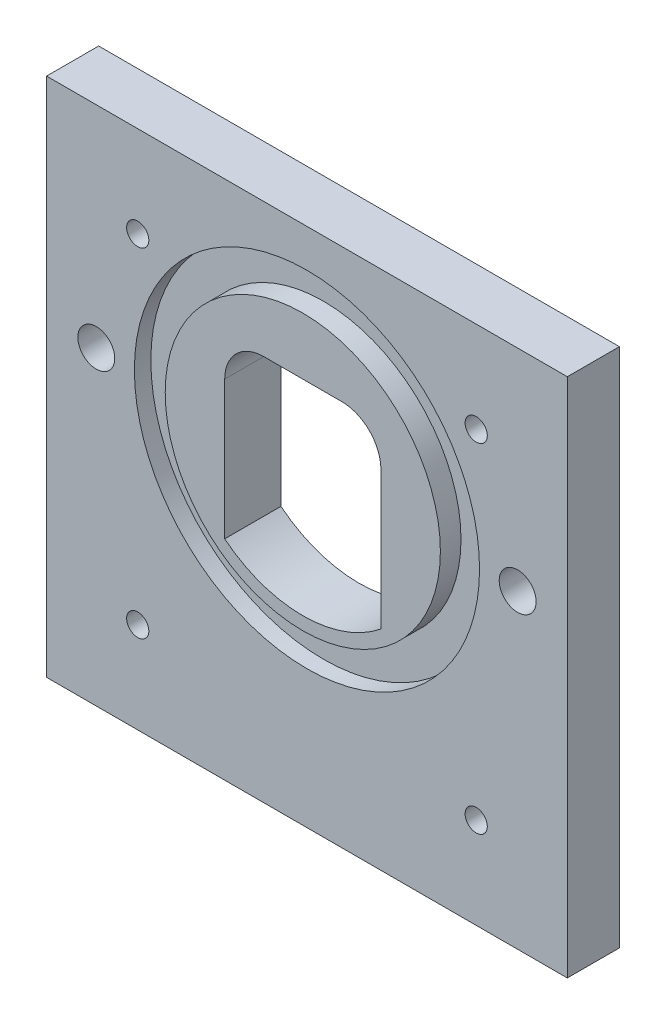
ISO-10303-21;
HEADER;
FILE_DESCRIPTION(('STEP AP214'),'2;1');
FILE_NAME('part.step','',(''),(''),'','','');
FILE_SCHEMA(('AUTOMOTIVE_DESIGN { 1 0 10303 214 1 1 1 1 }'));
ENDSEC;
DATA;
#1=APPLICATION_CONTEXT('core data for automotive mechanical design processes');
#2=APPLICATION_PROTOCOL_DEFINITION('international standard','automotive_design',2000,#1);
#3=PRODUCT_CONTEXT('',#1,'mechanical');
#4=PRODUCT('Part','Part','',(#3));
#5=PRODUCT_RELATED_PRODUCT_CATEGORY('part','',(#4));
#6=PRODUCT_DEFINITION_FORMATION('','',#4);
#7=PRODUCT_DEFINITION_CONTEXT('part definition',#1,'design');
#8=PRODUCT_DEFINITION('design','',#6,#7);
#9=PRODUCT_DEFINITION_SHAPE('','',#8);
#10=(LENGTH_UNIT() NAMED_UNIT(*) SI_UNIT(.MILLI.,.METRE.));
#11=(NAMED_UNIT(*) PLANE_ANGLE_UNIT() SI_UNIT($,.RADIAN.));
#12=(NAMED_UNIT(*) SI_UNIT($,.STERADIAN.) SOLID_ANGLE_UNIT());
#13=UNCERTAINTY_MEASURE_WITH_UNIT(LENGTH_MEASURE(1.E-05),#10,'distance_accuracy_value','');
#14=(GEOMETRIC_REPRESENTATION_CONTEXT(3) GLOBAL_UNCERTAINTY_ASSIGNED_CONTEXT((#13)) GLOBAL_UNIT_ASSIGNED_CONTEXT((#10,
#11,#12)) REPRESENTATION_CONTEXT('',''));
#15=CARTESIAN_POINT('',(0.,0.,0.));
#16=DIRECTION('',(0.,0.,1.));
#17=DIRECTION('',(1.,0.,0.));
#18=AXIS2_PLACEMENT_3D('',#15,#16,#17);
#19=CARTESIAN_POINT('',(31.75,-31.75,6.35));
#20=DIRECTION('',(-1.,0.,0.));
#21=DIRECTION('',(0.,0.,1.));
#22=AXIS2_PLACEMENT_3D('',#19,#20,#21);
#23=PLANE('',#22);
#24=DIRECTION('',(0.,1.,0.));
#25=VECTOR('',#24,1.);
#26=CARTESIAN_POINT('',(31.75,-31.75,0.));
#27=LINE('',#26,#25);
#28=CARTESIAN_POINT('',(31.75,-31.75,0.));
#29=VERTEX_POINT('',#28);
#30=CARTESIAN_POINT('',(31.75,31.75,0.));
#31=VERTEX_POINT('',#30);
#32=EDGE_CURVE('E211',#29,#31,#27,.T.);
#33=ORIENTED_EDGE('',*,*,#32,.T.);
#34=DIRECTION('',(0.,0.,-1.));
#35=VECTOR('',#34,1.);
#36=CARTESIAN_POINT('',(31.75,31.75,6.35));
#37=LINE('',#36,#35);
#38=CARTESIAN_POINT('',(31.75,31.75,6.35));
#39=VERTEX_POINT('',#38);
#40=EDGE_CURVE('E11',#39,#31,#37,.T.);
#41=ORIENTED_EDGE('',*,*,#40,.F.);
#42=DIRECTION('',(0.,1.,0.));
#43=VECTOR('',#42,1.);
#44=CARTESIAN_POINT('',(31.75,-31.75,6.35));
#45=LINE('',#44,#43);
#46=CARTESIAN_POINT('',(31.75,-31.75,6.35));
#47=VERTEX_POINT('',#46);
#48=EDGE_CURVE('E212',#47,#39,#45,.T.);
#49=ORIENTED_EDGE('',*,*,#48,.F.);
#50=DIRECTION('',(0.,0.,-1.));
#51=VECTOR('',#50,1.);
#52=CARTESIAN_POINT('',(31.75,-31.75,6.35));
#53=LINE('',#52,#51);
#54=EDGE_CURVE('E222',#47,#29,#53,.T.);
#55=ORIENTED_EDGE('',*,*,#54,.T.);
#56=EDGE_LOOP('',(#33,#41,#49,#55));
#57=FACE_BOUND('',#56,.T.);
#58=ADVANCED_FACE('F32',(#57),#23,.F.);
#59=CARTESIAN_POINT('',(-31.75,31.75,6.35));
#60=DIRECTION('',(0.,-1.,0.));
#61=DIRECTION('',(0.,0.,-1.));
#62=AXIS2_PLACEMENT_3D('',#59,#60,#61);
#63=PLANE('',#62);
#64=DIRECTION('',(-1.,0.,0.));
#65=VECTOR('',#64,1.);
#66=CARTESIAN_POINT('',(-31.75,31.75,0.));
#67=LINE('',#66,#65);
#68=CARTESIAN_POINT('',(-31.75,31.75,0.));
#69=VERTEX_POINT('',#68);
#70=EDGE_CURVE('E225',#31,#69,#67,.T.);
#71=ORIENTED_EDGE('',*,*,#70,.T.);
#72=DIRECTION('',(0.,0.,-1.));
#73=VECTOR('',#72,1.);
#74=CARTESIAN_POINT('',(-31.75,31.75,6.35));
#75=LINE('',#74,#73);
#76=CARTESIAN_POINT('',(-31.75,31.75,6.35));
#77=VERTEX_POINT('',#76);
#78=EDGE_CURVE('E40',#77,#69,#75,.T.);
#79=ORIENTED_EDGE('',*,*,#78,.F.);
#80=DIRECTION('',(-1.,0.,0.));
#81=VECTOR('',#80,1.);
#82=CARTESIAN_POINT('',(-31.75,31.75,6.35));
#83=LINE('',#82,#81);
#84=EDGE_CURVE('E215',#39,#77,#83,.T.);
#85=ORIENTED_EDGE('',*,*,#84,.F.);
#86=ORIENTED_EDGE('',*,*,#40,.T.);
#87=EDGE_LOOP('',(#71,#79,#85,#86));
#88=FACE_BOUND('',#87,.T.);
#89=ADVANCED_FACE('F257',(#88),#63,.F.);
#90=CARTESIAN_POINT('',(-31.75,-31.75,6.35));
#91=DIRECTION('',(1.,0.,0.));
#92=DIRECTION('',(0.,0.,-1.));
#93=AXIS2_PLACEMENT_3D('',#90,#91,#92);
#94=PLANE('',#93);
#95=DIRECTION('',(0.,-1.,0.));
#96=VECTOR('',#95,1.);
#97=CARTESIAN_POINT('',(-31.75,-31.75,0.));
#98=LINE('',#97,#96);
#99=CARTESIAN_POINT('',(-31.75,-31.75,0.));
#100=VERTEX_POINT('',#99);
#101=EDGE_CURVE('E227',#69,#100,#98,.T.);
#102=ORIENTED_EDGE('',*,*,#101,.T.);
#103=DIRECTION('',(0.,0.,-1.));
#104=VECTOR('',#103,1.);
#105=CARTESIAN_POINT('',(-31.75,-31.75,6.35));
#106=LINE('',#105,#104);
#107=CARTESIAN_POINT('',(-31.75,-31.75,6.35));
#108=VERTEX_POINT('',#107);
#109=EDGE_CURVE('E232',#108,#100,#106,.T.);
#110=ORIENTED_EDGE('',*,*,#109,.F.);
#111=DIRECTION('',(0.,-1.,0.));
#112=VECTOR('',#111,1.);
#113=CARTESIAN_POINT('',(-31.75,-31.75,6.35));
#114=LINE('',#113,#112);
#115=EDGE_CURVE('E218',#77,#108,#114,.T.);
#116=ORIENTED_EDGE('',*,*,#115,.F.);
#117=ORIENTED_EDGE('',*,*,#78,.T.);
#118=EDGE_LOOP('',(#102,#110,#116,#117));
#119=FACE_BOUND('',#118,.T.);
#120=ADVANCED_FACE('F262',(#119),#94,.F.);
#121=CARTESIAN_POINT('',(-31.75,-31.75,6.35));
#122=DIRECTION('',(0.,1.,0.));
#123=DIRECTION('',(0.,0.,1.));
#124=AXIS2_PLACEMENT_3D('',#121,#122,#123);
#125=PLANE('',#124);
#126=DIRECTION('',(1.,0.,0.));
#127=VECTOR('',#126,1.);
#128=CARTESIAN_POINT('',(-31.75,-31.75,0.));
#129=LINE('',#128,#127);
#130=EDGE_CURVE('E216',#100,#29,#129,.T.);
#131=ORIENTED_EDGE('',*,*,#130,.T.);
#132=ORIENTED_EDGE('',*,*,#54,.F.);
#133=DIRECTION('',(1.,0.,0.));
#134=VECTOR('',#133,1.);
#135=CARTESIAN_POINT('',(-31.75,-31.75,6.35));
#136=LINE('',#135,#134);
#137=EDGE_CURVE('E220',#108,#47,#136,.T.);
#138=ORIENTED_EDGE('',*,*,#137,.F.);
#139=ORIENTED_EDGE('',*,*,#109,.T.);
#140=EDGE_LOOP('',(#131,#132,#138,#139));
#141=FACE_BOUND('',#140,.T.);
#142=ADVANCED_FACE('F278',(#141),#125,.F.);
#143=CARTESIAN_POINT('',(31.75,31.75,6.35));
#144=DIRECTION('',(0.,0.,-1.));
#145=DIRECTION('',(-1.,0.,0.));
#146=AXIS2_PLACEMENT_3D('',#143,#144,#145);
#147=PLANE('',#146);
#148=CARTESIAN_POINT('',(25.6911768305445,6.07686515337297,6.35));
#149=DIRECTION('',(0.,0.,-1.));
#150=DIRECTION('',(-1.,0.,0.));
#151=AXIS2_PLACEMENT_3D('',#148,#149,#150);
#152=CIRCLE('',#151,2.25);
#153=CARTESIAN_POINT('',(23.4411768305445,6.07686515337297,6.35));
#154=VERTEX_POINT('',#153);
#155=EDGE_CURVE('E35',#154,#154,#152,.T.);
#156=ORIENTED_EDGE('',*,*,#155,.T.);
#157=EDGE_LOOP('',(#156));
#158=FACE_BOUND('',#157,.T.);
#159=CARTESIAN_POINT('',(-25.6911768305436,6.07686515337297,6.35));
#160=DIRECTION('',(0.,0.,-1.));
#161=DIRECTION('',(-1.,0.,0.));
#162=AXIS2_PLACEMENT_3D('',#159,#160,#161);
#163=CIRCLE('',#162,2.25);
#164=CARTESIAN_POINT('',(-27.9411768305436,6.07686515337297,6.35));
#165=VERTEX_POINT('',#164);
#166=EDGE_CURVE('E174',#165,#165,#163,.T.);
#167=ORIENTED_EDGE('',*,*,#166,.T.);
#168=EDGE_LOOP('',(#167));
#169=FACE_BOUND('',#168,.T.);
#170=CARTESIAN_POINT('',(1.67183974997265E-13,6.07686515337297,6.35));
#171=DIRECTION('',(0.,0.,1.));
#172=DIRECTION('',(1.,0.,0.));
#173=AXIS2_PLACEMENT_3D('',#170,#171,#172);
#174=CIRCLE('',#173,21.0439);
#175=CARTESIAN_POINT('',(21.0439000000002,6.07686515337297,6.35));
#176=VERTEX_POINT('',#175);
#177=EDGE_CURVE('E181',#176,#176,#174,.T.);
#178=ORIENTED_EDGE('',*,*,#177,.F.);
#179=EDGE_LOOP('',(#178));
#180=FACE_BOUND('',#179,.T.);
#181=CARTESIAN_POINT('',(-20.6375,-20.6375,6.35));
#182=DIRECTION('',(0.,0.,-1.));
#183=DIRECTION('',(-1.,0.,0.));
#184=AXIS2_PLACEMENT_3D('',#181,#182,#183);
#185=CIRCLE('',#184,1.35255);
#186=CARTESIAN_POINT('',(-21.99005,-20.6375,6.35));
#187=VERTEX_POINT('',#186);
#188=EDGE_CURVE('E190',#187,#187,#185,.T.);
#189=ORIENTED_EDGE('',*,*,#188,.T.);
#190=EDGE_LOOP('',(#189));
#191=FACE_BOUND('',#190,.T.);
#192=CARTESIAN_POINT('',(20.6375,-20.6375,6.35));
#193=DIRECTION('',(0.,0.,-1.));
#194=DIRECTION('',(-1.,0.,0.));
#195=AXIS2_PLACEMENT_3D('',#192,#193,#194);
#196=CIRCLE('',#195,1.35255);
#197=CARTESIAN_POINT('',(19.28495,-20.6375,6.35));
#198=VERTEX_POINT('',#197);
#199=EDGE_CURVE('E196',#198,#198,#196,.T.);
#200=ORIENTED_EDGE('',*,*,#199,.T.);
#201=EDGE_LOOP('',(#200));
#202=FACE_BOUND('',#201,.T.);
#203=CARTESIAN_POINT('',(20.6375,20.6375,6.35));
#204=DIRECTION('',(0.,0.,-1.));
#205=DIRECTION('',(-1.,0.,0.));
#206=AXIS2_PLACEMENT_3D('',#203,#204,#205);
#207=CIRCLE('',#206,1.35255);
#208=CARTESIAN_POINT('',(19.28495,20.6375,6.35));
#209=VERTEX_POINT('',#208);
#210=EDGE_CURVE('E202',#209,#209,#207,.T.);
#211=ORIENTED_EDGE('',*,*,#210,.T.);
#212=EDGE_LOOP('',(#211));
#213=FACE_BOUND('',#212,.T.);
#214=CARTESIAN_POINT('',(-20.6375,20.6375,6.35));
#215=DIRECTION('',(0.,0.,-1.));
#216=DIRECTION('',(-1.,0.,0.));
#217=AXIS2_PLACEMENT_3D('',#214,#215,#216);
#218=CIRCLE('',#217,1.35255);
#219=CARTESIAN_POINT('',(-21.99005,20.6375,6.35));
#220=VERTEX_POINT('',#219);
#221=EDGE_CURVE('E208',#220,#220,#218,.T.);
#222=ORIENTED_EDGE('',*,*,#221,.T.);
#223=EDGE_LOOP('',(#222));
#224=FACE_BOUND('',#223,.T.);
#225=ORIENTED_EDGE('',*,*,#48,.T.);
#226=ORIENTED_EDGE('',*,*,#84,.T.);
#227=ORIENTED_EDGE('',*,*,#115,.T.);
#228=ORIENTED_EDGE('',*,*,#137,.T.);
#229=EDGE_LOOP('',(#225,#226,#227,#228));
#230=FACE_BOUND('',#229,.T.);
#231=ADVANCED_FACE('F239',(#158,#169,#180,#191,#202,#213,#224,#230),#147,.F.);
#232=CARTESIAN_POINT('',(31.75,31.75,0.));
#233=DIRECTION('',(0.,0.,-1.));
#234=DIRECTION('',(-1.,0.,0.));
#235=AXIS2_PLACEMENT_3D('',#232,#233,#234);
#236=PLANE('',#235);
#237=CARTESIAN_POINT('',(-4.7625,11.1125,0.));
#238=DIRECTION('',(0.,0.,-1.));
#239=DIRECTION('',(-1.,0.,0.));
#240=AXIS2_PLACEMENT_3D('',#237,#238,#239);
#241=CIRCLE('',#240,4.7625);
#242=CARTESIAN_POINT('',(-9.525,11.1125,0.));
#243=VERTEX_POINT('',#242);
#244=CARTESIAN_POINT('',(-4.7625,15.875,0.));
#245=VERTEX_POINT('',#244);
#246=EDGE_CURVE('E48',#243,#245,#241,.T.);
#247=ORIENTED_EDGE('',*,*,#246,.F.);
#248=DIRECTION('',(0.,1.,0.));
#249=VECTOR('',#248,1.);
#250=CARTESIAN_POINT('',(-9.525,11.1125,0.));
#251=LINE('',#250,#249);
#252=CARTESIAN_POINT('',(-9.525,-5.75471004353972,0.));
#253=VERTEX_POINT('',#252);
#254=EDGE_CURVE('E129',#253,#243,#251,.T.);
#255=ORIENTED_EDGE('',*,*,#254,.F.);
#256=CARTESIAN_POINT('',(0.,6.07686515337317,0.));
#257=DIRECTION('',(0.,0.,-1.));
#258=DIRECTION('',(-1.,0.,0.));
#259=AXIS2_PLACEMENT_3D('',#256,#257,#258);
#260=CIRCLE('',#259,15.1892000000067);
#261=CARTESIAN_POINT('',(9.525,-5.75471004353972,0.));
#262=VERTEX_POINT('',#261);
#263=EDGE_CURVE('E132',#262,#253,#260,.T.);
#264=ORIENTED_EDGE('',*,*,#263,.F.);
#265=DIRECTION('',(0.,-1.,0.));
#266=VECTOR('',#265,1.);
#267=CARTESIAN_POINT('',(9.525,11.1125,0.));
#268=LINE('',#267,#266);
#269=CARTESIAN_POINT('',(9.525,11.1125,0.));
#270=VERTEX_POINT('',#269);
#271=EDGE_CURVE('E148',#270,#262,#268,.T.);
#272=ORIENTED_EDGE('',*,*,#271,.F.);
#273=CARTESIAN_POINT('',(4.7625,11.1125,0.));
#274=DIRECTION('',(0.,0.,-1.));
#275=DIRECTION('',(1.,0.,0.));
#276=AXIS2_PLACEMENT_3D('',#273,#274,#275);
#277=CIRCLE('',#276,4.7625);
#278=CARTESIAN_POINT('',(4.7625,15.875,0.));
#279=VERTEX_POINT('',#278);
#280=EDGE_CURVE('E145',#279,#270,#277,.T.);
#281=ORIENTED_EDGE('',*,*,#280,.F.);
#282=DIRECTION('',(1.,0.,0.));
#283=VECTOR('',#282,1.);
#284=CARTESIAN_POINT('',(-4.7625,15.875,0.));
#285=LINE('',#284,#283);
#286=EDGE_CURVE('E143',#245,#279,#285,.T.);
#287=ORIENTED_EDGE('',*,*,#286,.F.);
#288=EDGE_LOOP('',(#247,#255,#264,#272,#281,#287));
#289=FACE_BOUND('',#288,.T.);
#290=CARTESIAN_POINT('',(25.6911768305445,6.07686515337297,0.));
#291=DIRECTION('',(0.,0.,-1.));
#292=DIRECTION('',(-1.,0.,0.));
#293=AXIS2_PLACEMENT_3D('',#290,#291,#292);
#294=CIRCLE('',#293,4.7);
#295=CARTESIAN_POINT('',(20.9911768305445,6.07686515337297,0.));
#296=VERTEX_POINT('',#295);
#297=EDGE_CURVE('E155',#296,#296,#294,.T.);
#298=ORIENTED_EDGE('',*,*,#297,.F.);
#299=EDGE_LOOP('',(#298));
#300=FACE_BOUND('',#299,.T.);
#301=CARTESIAN_POINT('',(-25.6911768305436,6.07686515337297,0.));
#302=DIRECTION('',(0.,0.,-1.));
#303=DIRECTION('',(-1.,0.,0.));
#304=AXIS2_PLACEMENT_3D('',#301,#302,#303);
#305=CIRCLE('',#304,4.7);
#306=CARTESIAN_POINT('',(-30.3911768305436,6.07686515337297,0.));
#307=VERTEX_POINT('',#306);
#308=EDGE_CURVE('E168',#307,#307,#305,.T.);
#309=ORIENTED_EDGE('',*,*,#308,.F.);
#310=EDGE_LOOP('',(#309));
#311=FACE_BOUND('',#310,.T.);
#312=CARTESIAN_POINT('',(-20.6375,-20.6375,0.));
#313=DIRECTION('',(0.,0.,-1.));
#314=DIRECTION('',(-1.,0.,0.));
#315=AXIS2_PLACEMENT_3D('',#312,#313,#314);
#316=CIRCLE('',#315,1.35254999999999);
#317=CARTESIAN_POINT('',(-21.99005,-20.6375,0.));
#318=VERTEX_POINT('',#317);
#319=EDGE_CURVE('E185',#318,#318,#316,.T.);
#320=ORIENTED_EDGE('',*,*,#319,.F.);
#321=EDGE_LOOP('',(#320));
#322=FACE_BOUND('',#321,.T.);
#323=CARTESIAN_POINT('',(20.6375,-20.6375,0.));
#324=DIRECTION('',(0.,0.,-1.));
#325=DIRECTION('',(-1.,0.,0.));
#326=AXIS2_PLACEMENT_3D('',#323,#324,#325);
#327=CIRCLE('',#326,1.35254999999999);
#328=CARTESIAN_POINT('',(19.28495,-20.6375,0.));
#329=VERTEX_POINT('',#328);
#330=EDGE_CURVE('E193',#329,#329,#327,.T.);
#331=ORIENTED_EDGE('',*,*,#330,.F.);
#332=EDGE_LOOP('',(#331));
#333=FACE_BOUND('',#332,.T.);
#334=CARTESIAN_POINT('',(20.6375,20.6375,0.));
#335=DIRECTION('',(0.,0.,-1.));
#336=DIRECTION('',(-1.,0.,0.));
#337=AXIS2_PLACEMENT_3D('',#334,#335,#336);
#338=CIRCLE('',#337,1.35254999999999);
#339=CARTESIAN_POINT('',(19.28495,20.6375,0.));
#340=VERTEX_POINT('',#339);
#341=EDGE_CURVE('E199',#340,#340,#338,.T.);
#342=ORIENTED_EDGE('',*,*,#341,.F.);
#343=EDGE_LOOP('',(#342));
#344=FACE_BOUND('',#343,.T.);
#345=CARTESIAN_POINT('',(-20.6375,20.6375,0.));
#346=DIRECTION('',(0.,0.,-1.));
#347=DIRECTION('',(-1.,0.,0.));
#348=AXIS2_PLACEMENT_3D('',#345,#346,#347);
#349=CIRCLE('',#348,1.35254999999999);
#350=CARTESIAN_POINT('',(-21.99005,20.6375,0.));
#351=VERTEX_POINT('',#350);
#352=EDGE_CURVE('E205',#351,#351,#349,.T.);
#353=ORIENTED_EDGE('',*,*,#352,.F.);
#354=EDGE_LOOP('',(#353));
#355=FACE_BOUND('',#354,.T.);
#356=ORIENTED_EDGE('',*,*,#32,.F.);
#357=ORIENTED_EDGE('',*,*,#130,.F.);
#358=ORIENTED_EDGE('',*,*,#101,.F.);
#359=ORIENTED_EDGE('',*,*,#70,.F.);
#360=EDGE_LOOP('',(#356,#357,#358,#359));
#361=FACE_BOUND('',#360,.T.);
#362=ADVANCED_FACE('F270',(#289,#300,#311,#322,#333,#344,#355,#361),#236,.T.);
#363=CARTESIAN_POINT('',(-20.6375,20.6375,0.));
#364=DIRECTION('',(0.,0.,-1.));
#365=DIRECTION('',(-1.,0.,0.));
#366=AXIS2_PLACEMENT_3D('',#363,#364,#365);
#367=CYLINDRICAL_SURFACE('',#366,1.35254999999999);
#368=ORIENTED_EDGE('',*,*,#221,.F.);
#369=EDGE_LOOP('',(#368));
#370=FACE_BOUND('',#369,.T.);
#371=ORIENTED_EDGE('',*,*,#352,.T.);
#372=EDGE_LOOP('',(#371));
#373=FACE_BOUND('',#372,.T.);
#374=ADVANCED_FACE('F289',(#370,#373),#367,.F.);
#375=CARTESIAN_POINT('',(20.6375,20.6375,0.));
#376=DIRECTION('',(0.,0.,-1.));
#377=DIRECTION('',(-1.,0.,0.));
#378=AXIS2_PLACEMENT_3D('',#375,#376,#377);
#379=CYLINDRICAL_SURFACE('',#378,1.35254999999999);
#380=ORIENTED_EDGE('',*,*,#210,.F.);
#381=EDGE_LOOP('',(#380));
#382=FACE_BOUND('',#381,.T.);
#383=ORIENTED_EDGE('',*,*,#341,.T.);
#384=EDGE_LOOP('',(#383));
#385=FACE_BOUND('',#384,.T.);
#386=ADVANCED_FACE('F296',(#382,#385),#379,.F.);
#387=CARTESIAN_POINT('',(20.6375,-20.6375,0.));
#388=DIRECTION('',(0.,0.,-1.));
#389=DIRECTION('',(-1.,0.,0.));
#390=AXIS2_PLACEMENT_3D('',#387,#388,#389);
#391=CYLINDRICAL_SURFACE('',#390,1.35254999999999);
#392=ORIENTED_EDGE('',*,*,#199,.F.);
#393=EDGE_LOOP('',(#392));
#394=FACE_BOUND('',#393,.T.);
#395=ORIENTED_EDGE('',*,*,#330,.T.);
#396=EDGE_LOOP('',(#395));
#397=FACE_BOUND('',#396,.T.);
#398=ADVANCED_FACE('F300',(#394,#397),#391,.F.);
#399=CARTESIAN_POINT('',(-20.6375,-20.6375,0.));
#400=DIRECTION('',(0.,0.,-1.));
#401=DIRECTION('',(-1.,0.,0.));
#402=AXIS2_PLACEMENT_3D('',#399,#400,#401);
#403=CYLINDRICAL_SURFACE('',#402,1.35254999999999);
#404=ORIENTED_EDGE('',*,*,#188,.F.);
#405=EDGE_LOOP('',(#404));
#406=FACE_BOUND('',#405,.T.);
#407=ORIENTED_EDGE('',*,*,#319,.T.);
#408=EDGE_LOOP('',(#407));
#409=FACE_BOUND('',#408,.T.);
#410=ADVANCED_FACE('F304',(#406,#409),#403,.F.);
#411=CARTESIAN_POINT('',(1.67183974997265E-13,6.07686515337297,4.3434));
#412=DIRECTION('',(0.,0.,1.));
#413=DIRECTION('',(1.,0.,0.));
#414=AXIS2_PLACEMENT_3D('',#411,#412,#413);
#415=CYLINDRICAL_SURFACE('',#414,21.0439);
#416=CARTESIAN_POINT('',(1.67183974997265E-13,6.07686515337297,4.3434));
#417=DIRECTION('',(0.,0.,1.));
#418=DIRECTION('',(1.,0.,0.));
#419=AXIS2_PLACEMENT_3D('',#416,#417,#418);
#420=CIRCLE('',#419,21.0439);
#421=CARTESIAN_POINT('',(21.0439000000002,6.07686515337297,4.3434));
#422=VERTEX_POINT('',#421);
#423=EDGE_CURVE('E182',#422,#422,#420,.T.);
#424=ORIENTED_EDGE('',*,*,#423,.F.);
#425=EDGE_LOOP('',(#424));
#426=FACE_BOUND('',#425,.T.);
#427=ORIENTED_EDGE('',*,*,#177,.T.);
#428=EDGE_LOOP('',(#427));
#429=FACE_BOUND('',#428,.T.);
#430=ADVANCED_FACE('F308',(#426,#429),#415,.F.);
#431=CARTESIAN_POINT('',(1.67183974997265E-13,6.07686515337297,4.3434));
#432=DIRECTION('',(0.,0.,1.));
#433=DIRECTION('',(1.,0.,0.));
#434=AXIS2_PLACEMENT_3D('',#431,#432,#433);
#435=PLANE('',#434);
#436=CARTESIAN_POINT('',(1.67183974997265E-13,6.07686515337297,4.3434));
#437=DIRECTION('',(0.,0.,1.));
#438=DIRECTION('',(1.,0.,0.));
#439=AXIS2_PLACEMENT_3D('',#436,#437,#438);
#440=CIRCLE('',#439,16.7767);
#441=CARTESIAN_POINT('',(16.7767000000002,6.07686515337297,4.3434));
#442=VERTEX_POINT('',#441);
#443=EDGE_CURVE('E178',#442,#442,#440,.T.);
#444=ORIENTED_EDGE('',*,*,#443,.F.);
#445=EDGE_LOOP('',(#444));
#446=FACE_BOUND('',#445,.T.);
#447=ORIENTED_EDGE('',*,*,#423,.T.);
#448=EDGE_LOOP('',(#447));
#449=FACE_BOUND('',#448,.T.);
#450=ADVANCED_FACE('F312',(#446,#449),#435,.T.);
#451=CARTESIAN_POINT('',(1.67183974997265E-13,6.07686515337297,4.3434));
#452=DIRECTION('',(0.,0.,1.));
#453=DIRECTION('',(1.,0.,0.));
#454=AXIS2_PLACEMENT_3D('',#451,#452,#453);
#455=CYLINDRICAL_SURFACE('',#454,16.7767);
#456=ORIENTED_EDGE('',*,*,#443,.T.);
#457=EDGE_LOOP('',(#456));
#458=FACE_BOUND('',#457,.T.);
#459=CARTESIAN_POINT('',(1.67183974997265E-13,6.07686515337297,6.858));
#460=DIRECTION('',(0.,0.,1.));
#461=DIRECTION('',(1.,0.,0.));
#462=AXIS2_PLACEMENT_3D('',#459,#460,#461);
#463=CIRCLE('',#462,16.7767000000067);
#464=CARTESIAN_POINT('',(16.7767000000068,6.07686515337297,6.858));
#465=VERTEX_POINT('',#464);
#466=EDGE_CURVE('E175',#465,#465,#463,.T.);
#467=ORIENTED_EDGE('',*,*,#466,.F.);
#468=EDGE_LOOP('',(#467));
#469=FACE_BOUND('',#468,.T.);
#470=ADVANCED_FACE('F254',(#458,#469),#455,.T.);
#471=CARTESIAN_POINT('',(1.67183974997265E-13,6.07686515337297,6.858));
#472=DIRECTION('',(0.,0.,1.));
#473=DIRECTION('',(1.,0.,0.));
#474=AXIS2_PLACEMENT_3D('',#471,#472,#473);
#475=PLANE('',#474);
#476=CARTESIAN_POINT('',(-4.7625,11.1125,6.858));
#477=DIRECTION('',(0.,0.,-1.));
#478=DIRECTION('',(-1.,0.,0.));
#479=AXIS2_PLACEMENT_3D('',#476,#477,#478);
#480=CIRCLE('',#479,4.7625);
#481=CARTESIAN_POINT('',(-9.525,11.1125,6.858));
#482=VERTEX_POINT('',#481);
#483=CARTESIAN_POINT('',(-4.7625,15.875,6.858));
#484=VERTEX_POINT('',#483);
#485=EDGE_CURVE('E112',#482,#484,#480,.T.);
#486=ORIENTED_EDGE('',*,*,#485,.T.);
#487=DIRECTION('',(1.,0.,0.));
#488=VECTOR('',#487,1.);
#489=CARTESIAN_POINT('',(-4.7625,15.875,6.858));
#490=LINE('',#489,#488);
#491=CARTESIAN_POINT('',(4.7625,15.875,6.858));
#492=VERTEX_POINT('',#491);
#493=EDGE_CURVE('E121',#484,#492,#490,.T.);
#494=ORIENTED_EDGE('',*,*,#493,.T.);
#495=CARTESIAN_POINT('',(4.7625,11.1125,6.858));
#496=DIRECTION('',(0.,0.,-1.));
#497=DIRECTION('',(1.,0.,0.));
#498=AXIS2_PLACEMENT_3D('',#495,#496,#497);
#499=CIRCLE('',#498,4.7625);
#500=CARTESIAN_POINT('',(9.525,11.1125,6.858));
#501=VERTEX_POINT('',#500);
#502=EDGE_CURVE('E56',#492,#501,#499,.T.);
#503=ORIENTED_EDGE('',*,*,#502,.T.);
#504=DIRECTION('',(0.,-1.,0.));
#505=VECTOR('',#504,1.);
#506=CARTESIAN_POINT('',(9.525,11.1125,6.858));
#507=LINE('',#506,#505);
#508=CARTESIAN_POINT('',(9.525,-5.75471004353972,6.858));
#509=VERTEX_POINT('',#508);
#510=EDGE_CURVE('E136',#501,#509,#507,.T.);
#511=ORIENTED_EDGE('',*,*,#510,.T.);
#512=CARTESIAN_POINT('',(0.,6.07686515337317,6.858));
#513=DIRECTION('',(0.,0.,-1.));
#514=DIRECTION('',(-1.,0.,0.));
#515=AXIS2_PLACEMENT_3D('',#512,#513,#514);
#516=CIRCLE('',#515,15.1892000000067);
#517=CARTESIAN_POINT('',(-9.525,-5.75471004353972,6.858));
#518=VERTEX_POINT('',#517);
#519=EDGE_CURVE('E139',#509,#518,#516,.T.);
#520=ORIENTED_EDGE('',*,*,#519,.T.);
#521=DIRECTION('',(0.,1.,0.));
#522=VECTOR('',#521,1.);
#523=CARTESIAN_POINT('',(-9.525,11.1125,6.858));
#524=LINE('',#523,#522);
#525=EDGE_CURVE('E118',#518,#482,#524,.T.);
#526=ORIENTED_EDGE('',*,*,#525,.T.);
#527=EDGE_LOOP('',(#486,#494,#503,#511,#520,#526));
#528=FACE_BOUND('',#527,.T.);
#529=ORIENTED_EDGE('',*,*,#466,.T.);
#530=EDGE_LOOP('',(#529));
#531=FACE_BOUND('',#530,.T.);
#532=ADVANCED_FACE('F125',(#528,#531),#475,.T.);
#533=CARTESIAN_POINT('',(-25.6911768305436,6.07686515337297,0.));
#534=DIRECTION('',(0.,0.,-1.));
#535=DIRECTION('',(-1.,0.,0.));
#536=AXIS2_PLACEMENT_3D('',#533,#534,#535);
#537=CYLINDRICAL_SURFACE('',#536,2.25);
#538=CARTESIAN_POINT('',(-25.6911768305436,6.07686515337297,2.45));
#539=DIRECTION('',(0.,0.,-1.));
#540=DIRECTION('',(-1.,0.,0.));
#541=AXIS2_PLACEMENT_3D('',#538,#539,#540);
#542=CIRCLE('',#541,2.25);
#543=CARTESIAN_POINT('',(-27.9411768305436,6.07686515337297,2.45));
#544=VERTEX_POINT('',#543);
#545=EDGE_CURVE('E171',#544,#544,#542,.T.);
#546=ORIENTED_EDGE('',*,*,#545,.T.);
#547=EDGE_LOOP('',(#546));
#548=FACE_BOUND('',#547,.T.);
#549=ORIENTED_EDGE('',*,*,#166,.F.);
#550=EDGE_LOOP('',(#549));
#551=FACE_BOUND('',#550,.T.);
#552=ADVANCED_FACE('F242',(#548,#551),#537,.F.);
#553=CARTESIAN_POINT('',(-25.6911768305436,6.07686515337297,0.));
#554=DIRECTION('',(0.,0.,-1.));
#555=DIRECTION('',(-1.,0.,0.));
#556=AXIS2_PLACEMENT_3D('',#553,#554,#555);
#557=CONICAL_SURFACE('',#556,4.7,0.785398163397448);
#558=ORIENTED_EDGE('',*,*,#545,.F.);
#559=EDGE_LOOP('',(#558));
#560=FACE_BOUND('',#559,.T.);
#561=ORIENTED_EDGE('',*,*,#308,.T.);
#562=EDGE_LOOP('',(#561));
#563=FACE_BOUND('',#562,.T.);
#564=ADVANCED_FACE('F244',(#560,#563),#557,.F.);
#565=CARTESIAN_POINT('',(25.6911768305445,6.07686515337297,0.));
#566=DIRECTION('',(0.,0.,-1.));
#567=DIRECTION('',(-1.,0.,0.));
#568=AXIS2_PLACEMENT_3D('',#565,#566,#567);
#569=CYLINDRICAL_SURFACE('',#568,2.25);
#570=CARTESIAN_POINT('',(25.6911768305445,6.07686515337297,2.45));
#571=DIRECTION('',(0.,0.,-1.));
#572=DIRECTION('',(-1.,0.,0.));
#573=AXIS2_PLACEMENT_3D('',#570,#571,#572);
#574=CIRCLE('',#573,2.25);
#575=CARTESIAN_POINT('',(23.4411768305445,6.07686515337297,2.45));
#576=VERTEX_POINT('',#575);
#577=EDGE_CURVE('E165',#576,#576,#574,.T.);
#578=ORIENTED_EDGE('',*,*,#577,.T.);
#579=EDGE_LOOP('',(#578));
#580=FACE_BOUND('',#579,.T.);
#581=ORIENTED_EDGE('',*,*,#155,.F.);
#582=EDGE_LOOP('',(#581));
#583=FACE_BOUND('',#582,.T.);
#584=ADVANCED_FACE('F251',(#580,#583),#569,.F.);
#585=CARTESIAN_POINT('',(25.6911768305445,6.07686515337297,0.));
#586=DIRECTION('',(0.,0.,-1.));
#587=DIRECTION('',(-1.,0.,0.));
#588=AXIS2_PLACEMENT_3D('',#585,#586,#587);
#589=CONICAL_SURFACE('',#588,4.7,0.785398163397448);
#590=ORIENTED_EDGE('',*,*,#577,.F.);
#591=EDGE_LOOP('',(#590));
#592=FACE_BOUND('',#591,.T.);
#593=ORIENTED_EDGE('',*,*,#297,.T.);
#594=EDGE_LOOP('',(#593));
#595=FACE_BOUND('',#594,.T.);
#596=ADVANCED_FACE('F370',(#592,#595),#589,.F.);
#597=CARTESIAN_POINT('',(-4.7625,11.1125,6.858));
#598=DIRECTION('',(0.,0.,-1.));
#599=DIRECTION('',(-1.,0.,0.));
#600=AXIS2_PLACEMENT_3D('',#597,#598,#599);
#601=CYLINDRICAL_SURFACE('',#600,4.7625);
#602=ORIENTED_EDGE('',*,*,#246,.T.);
#603=DIRECTION('',(0.,0.,-1.));
#604=VECTOR('',#603,1.);
#605=CARTESIAN_POINT('',(-4.7625,15.875,6.858));
#606=LINE('',#605,#604);
#607=EDGE_CURVE('E108',#484,#245,#606,.T.);
#608=ORIENTED_EDGE('',*,*,#607,.F.);
#609=ORIENTED_EDGE('',*,*,#485,.F.);
#610=DIRECTION('',(0.,0.,-1.));
#611=VECTOR('',#610,1.);
#612=CARTESIAN_POINT('',(-9.525,11.1125,6.858));
#613=LINE('',#612,#611);
#614=EDGE_CURVE('E153',#482,#243,#613,.T.);
#615=ORIENTED_EDGE('',*,*,#614,.T.);
#616=EDGE_LOOP('',(#602,#608,#609,#615));
#617=FACE_BOUND('',#616,.T.);
#618=ADVANCED_FACE('F110',(#617),#601,.F.);
#619=CARTESIAN_POINT('',(-9.525,11.1125,6.858));
#620=DIRECTION('',(-1.,0.,0.));
#621=DIRECTION('',(0.,-1.,0.));
#622=AXIS2_PLACEMENT_3D('',#619,#620,#621);
#623=PLANE('',#622);
#624=ORIENTED_EDGE('',*,*,#254,.T.);
#625=ORIENTED_EDGE('',*,*,#614,.F.);
#626=ORIENTED_EDGE('',*,*,#525,.F.);
#627=DIRECTION('',(0.,0.,-1.));
#628=VECTOR('',#627,1.);
#629=CARTESIAN_POINT('',(-9.525,-5.75471004353972,6.858));
#630=LINE('',#629,#628);
#631=EDGE_CURVE('E156',#518,#253,#630,.T.);
#632=ORIENTED_EDGE('',*,*,#631,.T.);
#633=EDGE_LOOP('',(#624,#625,#626,#632));
#634=FACE_BOUND('',#633,.T.);
#635=ADVANCED_FACE('F369',(#634),#623,.F.);
#636=CARTESIAN_POINT('',(0.,6.07686515337317,6.858));
#637=DIRECTION('',(0.,0.,-1.));
#638=DIRECTION('',(-1.,0.,0.));
#639=AXIS2_PLACEMENT_3D('',#636,#637,#638);
#640=CYLINDRICAL_SURFACE('',#639,15.1892000000067);
#641=ORIENTED_EDGE('',*,*,#263,.T.);
#642=ORIENTED_EDGE('',*,*,#631,.F.);
#643=ORIENTED_EDGE('',*,*,#519,.F.);
#644=DIRECTION('',(0.,0.,-1.));
#645=VECTOR('',#644,1.);
#646=CARTESIAN_POINT('',(9.525,-5.75471004353972,6.858));
#647=LINE('',#646,#645);
#648=EDGE_CURVE('E158',#509,#262,#647,.T.);
#649=ORIENTED_EDGE('',*,*,#648,.T.);
#650=EDGE_LOOP('',(#641,#642,#643,#649));
#651=FACE_BOUND('',#650,.T.);
#652=ADVANCED_FACE('F381',(#651),#640,.F.);
#653=CARTESIAN_POINT('',(9.525,11.1125,6.858));
#654=DIRECTION('',(1.,0.,0.));
#655=DIRECTION('',(0.,1.,0.));
#656=AXIS2_PLACEMENT_3D('',#653,#654,#655);
#657=PLANE('',#656);
#658=ORIENTED_EDGE('',*,*,#271,.T.);
#659=ORIENTED_EDGE('',*,*,#648,.F.);
#660=ORIENTED_EDGE('',*,*,#510,.F.);
#661=DIRECTION('',(0.,0.,-1.));
#662=VECTOR('',#661,1.);
#663=CARTESIAN_POINT('',(9.525,11.1125,6.858));
#664=LINE('',#663,#662);
#665=EDGE_CURVE('E160',#501,#270,#664,.T.);
#666=ORIENTED_EDGE('',*,*,#665,.T.);
#667=EDGE_LOOP('',(#658,#659,#660,#666));
#668=FACE_BOUND('',#667,.T.);
#669=ADVANCED_FACE('F391',(#668),#657,.F.);
#670=CARTESIAN_POINT('',(4.7625,11.1125,6.858));
#671=DIRECTION('',(0.,0.,-1.));
#672=DIRECTION('',(-1.,0.,0.));
#673=AXIS2_PLACEMENT_3D('',#670,#671,#672);
#674=CYLINDRICAL_SURFACE('',#673,4.7625);
#675=ORIENTED_EDGE('',*,*,#280,.T.);
#676=ORIENTED_EDGE('',*,*,#665,.F.);
#677=ORIENTED_EDGE('',*,*,#502,.F.);
#678=DIRECTION('',(0.,0.,-1.));
#679=VECTOR('',#678,1.);
#680=CARTESIAN_POINT('',(4.7625,15.875,6.858));
#681=LINE('',#680,#679);
#682=EDGE_CURVE('E117',#492,#279,#681,.T.);
#683=ORIENTED_EDGE('',*,*,#682,.T.);
#684=EDGE_LOOP('',(#675,#676,#677,#683));
#685=FACE_BOUND('',#684,.T.);
#686=ADVANCED_FACE('F401',(#685),#674,.F.);
#687=CARTESIAN_POINT('',(-4.7625,15.875,6.858));
#688=DIRECTION('',(0.,1.,0.));
#689=DIRECTION('',(0.,0.,1.));
#690=AXIS2_PLACEMENT_3D('',#687,#688,#689);
#691=PLANE('',#690);
#692=ORIENTED_EDGE('',*,*,#286,.T.);
#693=ORIENTED_EDGE('',*,*,#682,.F.);
#694=ORIENTED_EDGE('',*,*,#493,.F.);
#695=ORIENTED_EDGE('',*,*,#607,.T.);
#696=EDGE_LOOP('',(#692,#693,#694,#695));
#697=FACE_BOUND('',#696,.T.);
#698=ADVANCED_FACE('F122',(#697),#691,.F.);
#699=CLOSED_SHELL('',(#58,#89,#120,#142,#231,#362,#374,#386,#398,#410,#430,#450,#470,#532,#552,
#564,#584,#596,#618,#635,#652,#669,#686,#698));
#700=MANIFOLD_SOLID_BREP('B2',#699);
#701=ADVANCED_BREP_SHAPE_REPRESENTATION('',(#18,#700),#14);
#702=SHAPE_DEFINITION_REPRESENTATION(#9,#701);
ENDSEC;
END-ISO-10303-21;
